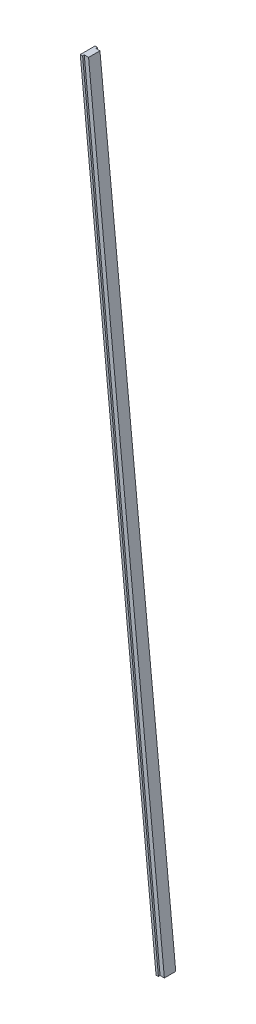
ISO-10303-21;
HEADER;
FILE_DESCRIPTION(('STEP AP214'),'2;1');
FILE_NAME('part.step','',(''),(''),'','','');
FILE_SCHEMA(('AUTOMOTIVE_DESIGN { 1 0 10303 214 1 1 1 1 }'));
ENDSEC;
DATA;
#1=APPLICATION_CONTEXT('core data for automotive mechanical design processes');
#2=APPLICATION_PROTOCOL_DEFINITION('international standard','automotive_design',2000,#1);
#3=PRODUCT_CONTEXT('',#1,'mechanical');
#4=PRODUCT('Part','Part','',(#3));
#5=PRODUCT_RELATED_PRODUCT_CATEGORY('part','',(#4));
#6=PRODUCT_DEFINITION_FORMATION('','',#4);
#7=PRODUCT_DEFINITION_CONTEXT('part definition',#1,'design');
#8=PRODUCT_DEFINITION('design','',#6,#7);
#9=PRODUCT_DEFINITION_SHAPE('','',#8);
#10=(LENGTH_UNIT() NAMED_UNIT(*) SI_UNIT(.MILLI.,.METRE.));
#11=(NAMED_UNIT(*) PLANE_ANGLE_UNIT() SI_UNIT($,.RADIAN.));
#12=(NAMED_UNIT(*) SI_UNIT($,.STERADIAN.) SOLID_ANGLE_UNIT());
#13=UNCERTAINTY_MEASURE_WITH_UNIT(LENGTH_MEASURE(1.E-05),#10,'distance_accuracy_value','');
#14=(GEOMETRIC_REPRESENTATION_CONTEXT(3) GLOBAL_UNCERTAINTY_ASSIGNED_CONTEXT((#13)) GLOBAL_UNIT_ASSIGNED_CONTEXT((#10,
#11,#12)) REPRESENTATION_CONTEXT('',''));
#15=CARTESIAN_POINT('',(0.,0.,0.));
#16=DIRECTION('',(0.,0.,1.));
#17=DIRECTION('',(1.,0.,0.));
#18=AXIS2_PLACEMENT_3D('',#15,#16,#17);
#19=CARTESIAN_POINT('',(-101.565446023058,7.37466516204734,-0.457273771904272));
#20=DIRECTION('',(0.995055569961227,0.0993197497436294,0.));
#21=DIRECTION('',(0.,0.,1.));
#22=AXIS2_PLACEMENT_3D('',#19,#20,#21);
#23=PLANE('',#22);
#24=DIRECTION('',(0.,0.,1.));
#25=VECTOR('',#24,1.);
#26=CARTESIAN_POINT('',(-100.923161092626,0.939799999999314,0.3556));
#27=LINE('',#26,#25);
#28=CARTESIAN_POINT('',(-100.923161092622,0.939799999999659,0.7112));
#29=VERTEX_POINT('',#28);
#30=CARTESIAN_POINT('',(-100.923161092622,0.93979999999966,0.));
#31=VERTEX_POINT('',#30);
#32=EDGE_CURVE('E124',#29,#31,#27,.F.);
#33=ORIENTED_EDGE('',*,*,#32,.F.);
#34=DIRECTION('',(-0.0993197497436666,0.995055569961224,0.));
#35=VECTOR('',#34,1.);
#36=CARTESIAN_POINT('',(-84.8570988929265,-160.021385669588,0.7112));
#37=LINE('',#36,#35);
#38=CARTESIAN_POINT('',(-68.8089145710214,-320.803458102494,0.7112));
#39=VERTEX_POINT('',#38);
#40=EDGE_CURVE('E122',#29,#39,#37,.F.);
#41=ORIENTED_EDGE('',*,*,#40,.T.);
#42=DIRECTION('',(0.,0.,-1.));
#43=VECTOR('',#42,1.);
#44=CARTESIAN_POINT('',(-68.8089145710244,-320.803458102494,3.12420000000025));
#45=LINE('',#44,#43);
#46=CARTESIAN_POINT('',(-68.8089145710244,-320.803458102494,0.));
#47=VERTEX_POINT('',#46);
#48=EDGE_CURVE('E75',#39,#47,#45,.T.);
#49=ORIENTED_EDGE('',*,*,#48,.T.);
#50=DIRECTION('',(0.0993197497436633,-0.995055569961224,0.));
#51=VECTOR('',#50,1.);
#52=CARTESIAN_POINT('',(-84.8709479532016,-159.882635979115,0.));
#53=LINE('',#52,#51);
#54=EDGE_CURVE('E74',#47,#31,#53,.F.);
#55=ORIENTED_EDGE('',*,*,#54,.T.);
#56=EDGE_LOOP('',(#33,#41,#49,#55));
#57=FACE_BOUND('',#56,.T.);
#58=ADVANCED_FACE('F17',(#57),#23,.T.);
#59=CARTESIAN_POINT('',(-102.020816394357,7.3328311101911,0.7112));
#60=DIRECTION('',(0.,0.,-1.));
#61=DIRECTION('',(0.995055569961194,0.0993197497439631,0.));
#62=AXIS2_PLACEMENT_3D('',#59,#60,#61);
#63=PLANE('',#62);
#64=DIRECTION('',(1.,0.,0.));
#65=VECTOR('',#64,1.);
#66=CARTESIAN_POINT('',(-100.514741691463,0.9398,0.7112));
#67=LINE('',#66,#65);
#68=CARTESIAN_POINT('',(-99.1108000000017,0.93979999999983,0.7112));
#69=VERTEX_POINT('',#68);
#70=EDGE_CURVE('E132',#29,#69,#67,.T.);
#71=ORIENTED_EDGE('',*,*,#70,.T.);
#72=DIRECTION('',(-0.0993197497436295,0.995055569961227,0.));
#73=VECTOR('',#72,1.);
#74=CARTESIAN_POINT('',(-83.0536767392028,-159.93182905122,0.7112));
#75=LINE('',#74,#73);
#76=CARTESIAN_POINT('',(-66.9965534783867,-320.803458102495,0.7112));
#77=VERTEX_POINT('',#76);
#78=EDGE_CURVE('E115',#69,#77,#75,.F.);
#79=ORIENTED_EDGE('',*,*,#78,.T.);
#80=DIRECTION('',(-1.,0.,0.));
#81=VECTOR('',#80,1.);
#82=CARTESIAN_POINT('',(-68.4004951698689,-320.803458102494,0.7112));
#83=LINE('',#82,#81);
#84=EDGE_CURVE('E82',#77,#39,#83,.T.);
#85=ORIENTED_EDGE('',*,*,#84,.T.);
#86=ORIENTED_EDGE('',*,*,#40,.F.);
#87=EDGE_LOOP('',(#71,#79,#85,#86));
#88=FACE_BOUND('',#87,.T.);
#89=ADVANCED_FACE('F155',(#88),#63,.T.);
#90=CARTESIAN_POINT('',(-99.753084930439,7.37466516204734,0.253926228095753));
#91=DIRECTION('',(0.995055569961227,0.0993197497436295,0.));
#92=DIRECTION('',(0.,0.,1.));
#93=AXIS2_PLACEMENT_3D('',#90,#91,#92);
#94=PLANE('',#93);
#95=DIRECTION('',(0.,0.,1.));
#96=VECTOR('',#95,1.);
#97=CARTESIAN_POINT('',(-99.1108,0.9398,3.12420000000025));
#98=LINE('',#97,#96);
#99=CARTESIAN_POINT('',(-99.1108000000035,0.939799999999651,5.5372));
#100=VERTEX_POINT('',#99);
#101=EDGE_CURVE('E137',#69,#100,#98,.T.);
#102=ORIENTED_EDGE('',*,*,#101,.T.);
#103=DIRECTION('',(-0.0993197497437047,0.99505556996122,0.));
#104=VECTOR('',#103,1.);
#105=CARTESIAN_POINT('',(-83.0626156780673,-159.842272432836,5.5372));
#106=LINE('',#105,#104);
#107=CARTESIAN_POINT('',(-66.9965534783834,-320.803458102494,5.5372));
#108=VERTEX_POINT('',#107);
#109=EDGE_CURVE('E112',#100,#108,#106,.F.);
#110=ORIENTED_EDGE('',*,*,#109,.T.);
#111=DIRECTION('',(0.,0.,-1.));
#112=VECTOR('',#111,1.);
#113=CARTESIAN_POINT('',(-66.9965534783802,-320.803458102494,3.12420000000025));
#114=LINE('',#113,#112);
#115=EDGE_CURVE('E142',#108,#77,#114,.T.);
#116=ORIENTED_EDGE('',*,*,#115,.T.);
#117=ORIENTED_EDGE('',*,*,#78,.F.);
#118=EDGE_LOOP('',(#102,#110,#116,#117));
#119=FACE_BOUND('',#118,.T.);
#120=ADVANCED_FACE('F162',(#119),#94,.T.);
#121=CARTESIAN_POINT('',(-99.316307552027,7.60277698005952,5.5372));
#122=DIRECTION('',(0.,0.,1.));
#123=DIRECTION('',(-0.995055569961194,-0.0993197497439631,0.));
#124=AXIS2_PLACEMENT_3D('',#121,#122,#123);
#125=PLANE('',#124);
#126=DIRECTION('',(-1.,0.,0.));
#127=VECTOR('',#126,1.);
#128=CARTESIAN_POINT('',(-100.514741691463,0.9398,5.5372));
#129=LINE('',#128,#127);
#130=CARTESIAN_POINT('',(-100.923161092621,0.939799999999828,5.5372));
#131=VERTEX_POINT('',#130);
#132=EDGE_CURVE('E87',#100,#131,#129,.T.);
#133=ORIENTED_EDGE('',*,*,#132,.T.);
#134=DIRECTION('',(-0.0993197497436294,0.995055569961227,0.));
#135=VECTOR('',#134,1.);
#136=CARTESIAN_POINT('',(-84.8660378318216,-159.93182905122,5.5372));
#137=LINE('',#136,#135);
#138=CARTESIAN_POINT('',(-68.8089145710183,-320.803458102493,5.5372));
#139=VERTEX_POINT('',#138);
#140=EDGE_CURVE('E95',#131,#139,#137,.F.);
#141=ORIENTED_EDGE('',*,*,#140,.T.);
#142=DIRECTION('',(1.,0.,0.));
#143=VECTOR('',#142,1.);
#144=CARTESIAN_POINT('',(-68.4004951698689,-320.803458102494,5.5372));
#145=LINE('',#144,#143);
#146=EDGE_CURVE('E94',#139,#108,#145,.T.);
#147=ORIENTED_EDGE('',*,*,#146,.T.);
#148=ORIENTED_EDGE('',*,*,#109,.F.);
#149=EDGE_LOOP('',(#133,#141,#147,#148));
#150=FACE_BOUND('',#149,.T.);
#151=ADVANCED_FACE('F151',(#150),#125,.T.);
#152=CARTESIAN_POINT('',(-101.565446023058,7.37466516204734,5.07992622809522));
#153=DIRECTION('',(0.995055569961227,0.0993197497436294,0.));
#154=DIRECTION('',(0.,0.,1.));
#155=AXIS2_PLACEMENT_3D('',#152,#153,#154);
#156=PLANE('',#155);
#157=DIRECTION('',(0.,0.,1.));
#158=VECTOR('',#157,1.);
#159=CARTESIAN_POINT('',(-100.923161092619,0.9398,3.12420000000025));
#160=LINE('',#159,#158);
#161=CARTESIAN_POINT('',(-100.923161092619,0.939799999999991,6.2484));
#162=VERTEX_POINT('',#161);
#163=EDGE_CURVE('E85',#131,#162,#160,.T.);
#164=ORIENTED_EDGE('',*,*,#163,.T.);
#165=DIRECTION('',(-0.0993197497436632,0.995055569961224,0.));
#166=VECTOR('',#165,1.);
#167=CARTESIAN_POINT('',(-84.8709479531716,-159.882635979112,6.2484));
#168=LINE('',#167,#166);
#169=CARTESIAN_POINT('',(-68.8089145710092,-320.803458102494,6.2484));
#170=VERTEX_POINT('',#169);
#171=EDGE_CURVE('E68',#162,#170,#168,.F.);
#172=ORIENTED_EDGE('',*,*,#171,.T.);
#173=DIRECTION('',(0.,0.,-1.));
#174=VECTOR('',#173,1.);
#175=CARTESIAN_POINT('',(-68.8089145710244,-320.803458102494,3.12420000000025));
#176=LINE('',#175,#174);
#177=EDGE_CURVE('E91',#170,#139,#176,.T.);
#178=ORIENTED_EDGE('',*,*,#177,.T.);
#179=ORIENTED_EDGE('',*,*,#140,.F.);
#180=EDGE_LOOP('',(#164,#172,#178,#179));
#181=FACE_BOUND('',#180,.T.);
#182=ADVANCED_FACE('F103',(#181),#156,.T.);
#183=CARTESIAN_POINT('',(-66.5392797064932,-320.803458102494,-0.457273771904272));
#184=DIRECTION('',(0.,1.,0.));
#185=DIRECTION('',(-1.,0.,0.));
#186=AXIS2_PLACEMENT_3D('',#183,#184,#185);
#187=PLANE('',#186);
#188=DIRECTION('',(0.,0.,1.));
#189=VECTOR('',#188,1.);
#190=CARTESIAN_POINT('',(-69.80443686132,-320.803458102493,3.12420000000025));
#191=LINE('',#190,#189);
#192=CARTESIAN_POINT('',(-69.80443686132,-320.803458102493,6.2484));
#193=VERTEX_POINT('',#192);
#194=CARTESIAN_POINT('',(-69.80443686132,-320.803458102493,0.));
#195=VERTEX_POINT('',#194);
#196=EDGE_CURVE('E57',#193,#195,#191,.F.);
#197=ORIENTED_EDGE('',*,*,#196,.T.);
#198=DIRECTION('',(-1.,0.,0.));
#199=VECTOR('',#198,1.);
#200=CARTESIAN_POINT('',(-66.5392797064932,-320.803458102494,0.));
#201=LINE('',#200,#199);
#202=EDGE_CURVE('E21',#195,#47,#201,.F.);
#203=ORIENTED_EDGE('',*,*,#202,.T.);
#204=ORIENTED_EDGE('',*,*,#48,.F.);
#205=ORIENTED_EDGE('',*,*,#84,.F.);
#206=ORIENTED_EDGE('',*,*,#115,.F.);
#207=ORIENTED_EDGE('',*,*,#146,.F.);
#208=ORIENTED_EDGE('',*,*,#177,.F.);
#209=DIRECTION('',(-1.,0.,0.));
#210=VECTOR('',#209,1.);
#211=CARTESIAN_POINT('',(-66.5392797064932,-320.803458102494,6.2484));
#212=LINE('',#211,#210);
#213=EDGE_CURVE('E63',#170,#193,#212,.T.);
#214=ORIENTED_EDGE('',*,*,#213,.T.);
#215=EDGE_LOOP('',(#197,#203,#204,#205,#206,#207,#208,#214));
#216=FACE_BOUND('',#215,.T.);
#217=ADVANCED_FACE('F59',(#216),#187,.F.);
#218=CARTESIAN_POINT('',(-103.016177531952,7.33121656834018,0.));
#219=DIRECTION('',(0.,0.,-1.));
#220=DIRECTION('',(0.995055569961153,0.0993197497443731,0.));
#221=AXIS2_PLACEMENT_3D('',#218,#219,#220);
#222=PLANE('',#221);
#223=DIRECTION('',(1.,0.,0.));
#224=VECTOR('',#223,1.);
#225=CARTESIAN_POINT('',(-100.514741691463,0.9398,0.));
#226=LINE('',#225,#224);
#227=CARTESIAN_POINT('',(-101.918683382947,0.939800000000453,0.));
#228=VERTEX_POINT('',#227);
#229=EDGE_CURVE('E83',#228,#31,#226,.T.);
#230=ORIENTED_EDGE('',*,*,#229,.T.);
#231=ORIENTED_EDGE('',*,*,#54,.F.);
#232=ORIENTED_EDGE('',*,*,#202,.F.);
#233=DIRECTION('',(0.0993197497436294,-0.995055569961227,0.));
#234=VECTOR('',#233,1.);
#235=CARTESIAN_POINT('',(-85.8615601221294,-159.93182905122,0.));
#236=LINE('',#235,#234);
#237=EDGE_CURVE('E67',#195,#228,#236,.F.);
#238=ORIENTED_EDGE('',*,*,#237,.T.);
#239=EDGE_LOOP('',(#230,#231,#232,#238));
#240=FACE_BOUND('',#239,.T.);
#241=ADVANCED_FACE('F72',(#240),#222,.T.);
#242=CARTESIAN_POINT('',(-102.375957154839,0.9398,-0.457273771904272));
#243=DIRECTION('',(0.,-1.,0.));
#244=DIRECTION('',(1.,0.,0.));
#245=AXIS2_PLACEMENT_3D('',#242,#243,#244);
#246=PLANE('',#245);
#247=DIRECTION('',(1.,0.,0.));
#248=VECTOR('',#247,1.);
#249=CARTESIAN_POINT('',(-102.375957154839,0.9398,6.2484));
#250=LINE('',#249,#248);
#251=CARTESIAN_POINT('',(-101.918683382934,0.939800000000902,6.2484));
#252=VERTEX_POINT('',#251);
#253=EDGE_CURVE('E90',#252,#162,#250,.T.);
#254=ORIENTED_EDGE('',*,*,#253,.T.);
#255=ORIENTED_EDGE('',*,*,#163,.F.);
#256=ORIENTED_EDGE('',*,*,#132,.F.);
#257=ORIENTED_EDGE('',*,*,#101,.F.);
#258=ORIENTED_EDGE('',*,*,#70,.F.);
#259=ORIENTED_EDGE('',*,*,#32,.T.);
#260=ORIENTED_EDGE('',*,*,#229,.F.);
#261=DIRECTION('',(0.,0.,-1.));
#262=VECTOR('',#261,1.);
#263=CARTESIAN_POINT('',(-101.918683382934,0.939800000001824,3.12420000000025));
#264=LINE('',#263,#262);
#265=EDGE_CURVE('E27',#228,#252,#264,.F.);
#266=ORIENTED_EDGE('',*,*,#265,.T.);
#267=EDGE_LOOP('',(#254,#255,#256,#257,#258,#259,#260,#266));
#268=FACE_BOUND('',#267,.T.);
#269=ADVANCED_FACE('F98',(#268),#246,.F.);
#270=CARTESIAN_POINT('',(-101.120449856892,7.52043534561688,6.2484));
#271=DIRECTION('',(0.,0.,1.));
#272=DIRECTION('',(-0.995055569961153,-0.0993197497443731,0.));
#273=AXIS2_PLACEMENT_3D('',#270,#271,#272);
#274=PLANE('',#273);
#275=ORIENTED_EDGE('',*,*,#253,.F.);
#276=DIRECTION('',(-0.0993197497436294,0.995055569961227,0.));
#277=VECTOR('',#276,1.);
#278=CARTESIAN_POINT('',(-85.8615601221294,-159.93182905122,6.2484));
#279=LINE('',#278,#277);
#280=EDGE_CURVE('E11',#252,#193,#279,.F.);
#281=ORIENTED_EDGE('',*,*,#280,.T.);
#282=ORIENTED_EDGE('',*,*,#213,.F.);
#283=ORIENTED_EDGE('',*,*,#171,.F.);
#284=EDGE_LOOP('',(#275,#281,#282,#283));
#285=FACE_BOUND('',#284,.T.);
#286=ADVANCED_FACE('F101',(#285),#274,.T.);
#287=CARTESIAN_POINT('',(-102.560968313366,7.37466516204734,6.70567377190478));
#288=DIRECTION('',(-0.995055569961227,-0.0993197497436295,0.));
#289=DIRECTION('',(0.,0.,-1.));
#290=AXIS2_PLACEMENT_3D('',#287,#288,#289);
#291=PLANE('',#290);
#292=ORIENTED_EDGE('',*,*,#265,.F.);
#293=ORIENTED_EDGE('',*,*,#237,.F.);
#294=ORIENTED_EDGE('',*,*,#196,.F.);
#295=ORIENTED_EDGE('',*,*,#280,.F.);
#296=EDGE_LOOP('',(#292,#293,#294,#295));
#297=FACE_BOUND('',#296,.T.);
#298=ADVANCED_FACE('F19',(#297),#291,.T.);
#299=CLOSED_SHELL('',(#58,#89,#120,#151,#182,#217,#241,#269,#286,#298));
#300=MANIFOLD_SOLID_BREP('B1',#299);
#301=ADVANCED_BREP_SHAPE_REPRESENTATION('',(#18,#300),#14);
#302=SHAPE_DEFINITION_REPRESENTATION(#9,#301);
ENDSEC;
END-ISO-10303-21;
